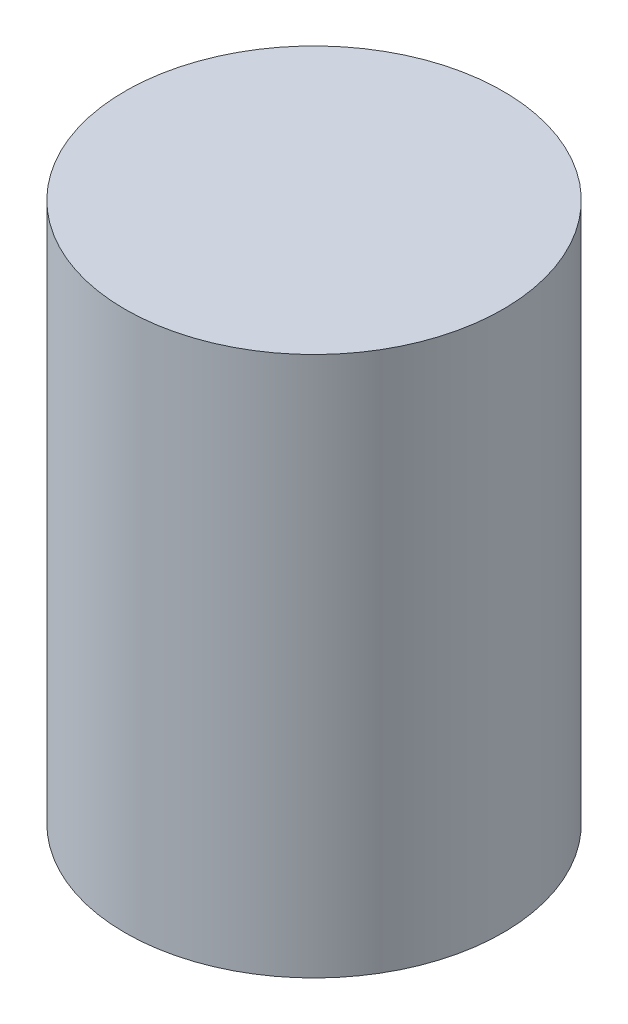
ISO-10303-21;
HEADER;
FILE_DESCRIPTION(('STEP AP214'),'2;1');
FILE_NAME('part.step','',(''),(''),'','','');
FILE_SCHEMA(('AUTOMOTIVE_DESIGN { 1 0 10303 214 1 1 1 1 }'));
ENDSEC;
DATA;
#1=APPLICATION_CONTEXT('core data for automotive mechanical design processes');
#2=APPLICATION_PROTOCOL_DEFINITION('international standard','automotive_design',2000,#1);
#3=PRODUCT_CONTEXT('',#1,'mechanical');
#4=PRODUCT('Part','Part','',(#3));
#5=PRODUCT_RELATED_PRODUCT_CATEGORY('part','',(#4));
#6=PRODUCT_DEFINITION_FORMATION('','',#4);
#7=PRODUCT_DEFINITION_CONTEXT('part definition',#1,'design');
#8=PRODUCT_DEFINITION('design','',#6,#7);
#9=PRODUCT_DEFINITION_SHAPE('','',#8);
#10=(LENGTH_UNIT() NAMED_UNIT(*) SI_UNIT(.MILLI.,.METRE.));
#11=(NAMED_UNIT(*) PLANE_ANGLE_UNIT() SI_UNIT($,.RADIAN.));
#12=(NAMED_UNIT(*) SI_UNIT($,.STERADIAN.) SOLID_ANGLE_UNIT());
#13=UNCERTAINTY_MEASURE_WITH_UNIT(LENGTH_MEASURE(1.E-05),#10,'distance_accuracy_value','');
#14=(GEOMETRIC_REPRESENTATION_CONTEXT(3) GLOBAL_UNCERTAINTY_ASSIGNED_CONTEXT((#13)) GLOBAL_UNIT_ASSIGNED_CONTEXT((#10,
#11,#12)) REPRESENTATION_CONTEXT('',''));
#15=CARTESIAN_POINT('',(0.,0.,0.));
#16=DIRECTION('',(0.,0.,1.));
#17=DIRECTION('',(1.,0.,0.));
#18=AXIS2_PLACEMENT_3D('',#15,#16,#17);
#19=CARTESIAN_POINT('',(0.,2.,0.));
#20=DIRECTION('',(0.,-1.,0.));
#21=DIRECTION('',(0.,0.,-1.));
#22=AXIS2_PLACEMENT_3D('',#19,#20,#21);
#23=CYLINDRICAL_SURFACE('',#22,0.699999999999999);
#24=CARTESIAN_POINT('',(0.,2.,0.));
#25=DIRECTION('',(0.,1.,0.));
#26=DIRECTION('',(0.,0.,1.));
#27=AXIS2_PLACEMENT_3D('',#24,#25,#26);
#28=CIRCLE('',#27,0.699999999999999);
#29=CARTESIAN_POINT('',(0.,2.,0.699999999999999));
#30=VERTEX_POINT('',#29);
#31=EDGE_CURVE('E10',#30,#30,#28,.T.);
#32=ORIENTED_EDGE('',*,*,#31,.F.);
#33=EDGE_LOOP('',(#32));
#34=FACE_BOUND('',#33,.T.);
#35=CARTESIAN_POINT('',(0.,0.,0.));
#36=DIRECTION('',(0.,1.,0.));
#37=DIRECTION('',(0.,0.,1.));
#38=AXIS2_PLACEMENT_3D('',#35,#36,#37);
#39=CIRCLE('',#38,0.699999999999999);
#40=CARTESIAN_POINT('',(0.,0.,0.699999999999999));
#41=VERTEX_POINT('',#40);
#42=EDGE_CURVE('E40',#41,#41,#39,.T.);
#43=ORIENTED_EDGE('',*,*,#42,.T.);
#44=EDGE_LOOP('',(#43));
#45=FACE_BOUND('',#44,.T.);
#46=ADVANCED_FACE('F37',(#34,#45),#23,.T.);
#47=CARTESIAN_POINT('',(0.,2.,0.));
#48=DIRECTION('',(0.,1.,0.));
#49=DIRECTION('',(0.,0.,1.));
#50=AXIS2_PLACEMENT_3D('',#47,#48,#49);
#51=PLANE('',#50);
#52=ORIENTED_EDGE('',*,*,#31,.T.);
#53=EDGE_LOOP('',(#52));
#54=FACE_BOUND('',#53,.T.);
#55=ADVANCED_FACE('F54',(#54),#51,.T.);
#56=CARTESIAN_POINT('',(0.,0.,0.));
#57=DIRECTION('',(0.,1.,0.));
#58=DIRECTION('',(0.,0.,1.));
#59=AXIS2_PLACEMENT_3D('',#56,#57,#58);
#60=PLANE('',#59);
#61=ORIENTED_EDGE('',*,*,#42,.F.);
#62=EDGE_LOOP('',(#61));
#63=FACE_BOUND('',#62,.T.);
#64=ADVANCED_FACE('F52',(#63),#60,.F.);
#65=CLOSED_SHELL('',(#46,#55,#64));
#66=MANIFOLD_SOLID_BREP('B2',#65);
#67=ADVANCED_BREP_SHAPE_REPRESENTATION('',(#18,#66),#14);
#68=SHAPE_DEFINITION_REPRESENTATION(#9,#67);
ENDSEC;
END-ISO-10303-21;
